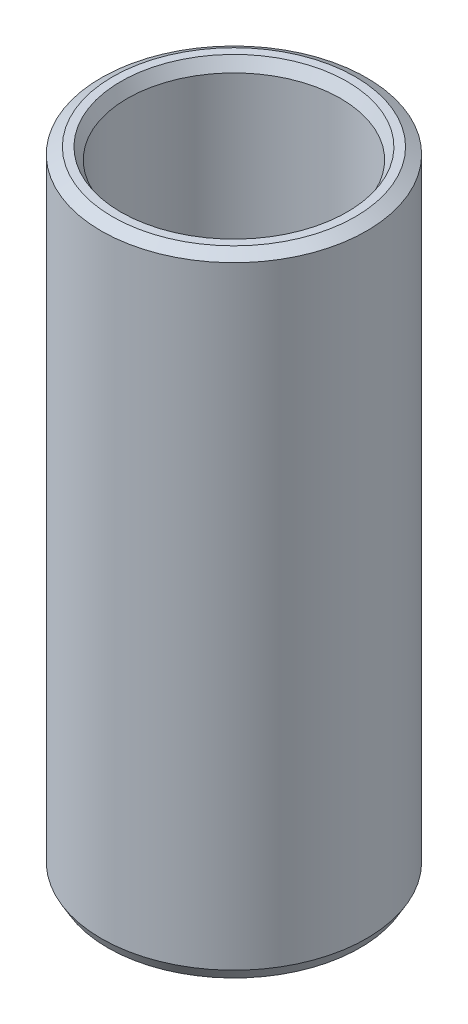
ISO-10303-21;
HEADER;
FILE_DESCRIPTION(('STEP AP214'),'2;1');
FILE_NAME('part.step','',(''),(''),'','','');
FILE_SCHEMA(('AUTOMOTIVE_DESIGN { 1 0 10303 214 1 1 1 1 }'));
ENDSEC;
DATA;
#1=APPLICATION_CONTEXT('core data for automotive mechanical design processes');
#2=APPLICATION_PROTOCOL_DEFINITION('international standard','automotive_design',2000,#1);
#3=PRODUCT_CONTEXT('',#1,'mechanical');
#4=PRODUCT('Part','Part','',(#3));
#5=PRODUCT_RELATED_PRODUCT_CATEGORY('part','',(#4));
#6=PRODUCT_DEFINITION_FORMATION('','',#4);
#7=PRODUCT_DEFINITION_CONTEXT('part definition',#1,'design');
#8=PRODUCT_DEFINITION('design','',#6,#7);
#9=PRODUCT_DEFINITION_SHAPE('','',#8);
#10=(LENGTH_UNIT() NAMED_UNIT(*) SI_UNIT(.MILLI.,.METRE.));
#11=(NAMED_UNIT(*) PLANE_ANGLE_UNIT() SI_UNIT($,.RADIAN.));
#12=(NAMED_UNIT(*) SI_UNIT($,.STERADIAN.) SOLID_ANGLE_UNIT());
#13=UNCERTAINTY_MEASURE_WITH_UNIT(LENGTH_MEASURE(1.E-05),#10,'distance_accuracy_value','');
#14=(GEOMETRIC_REPRESENTATION_CONTEXT(3) GLOBAL_UNCERTAINTY_ASSIGNED_CONTEXT((#13)) GLOBAL_UNIT_ASSIGNED_CONTEXT((#10,
#11,#12)) REPRESENTATION_CONTEXT('',''));
#15=CARTESIAN_POINT('',(0.,0.,0.));
#16=DIRECTION('',(0.,0.,1.));
#17=DIRECTION('',(1.,0.,0.));
#18=AXIS2_PLACEMENT_3D('',#15,#16,#17);
#19=CARTESIAN_POINT('',(0.,261.363555671817,0.));
#20=DIRECTION('',(0.,-1.,0.));
#21=DIRECTION('',(0.,0.,-1.));
#22=AXIS2_PLACEMENT_3D('',#19,#20,#21);
#23=CYLINDRICAL_SURFACE('',#22,55.);
#24=CARTESIAN_POINT('',(0.,4.71220692512941,0.));
#25=DIRECTION('',(0.,1.,0.));
#26=DIRECTION('',(0.,0.,1.));
#27=AXIS2_PLACEMENT_3D('',#24,#25,#26);
#28=CIRCLE('',#27,55.);
#29=CARTESIAN_POINT('',(0.,4.71220692512941,55.));
#30=VERTEX_POINT('',#29);
#31=EDGE_CURVE('E10',#30,#30,#28,.T.);
#32=ORIENTED_EDGE('',*,*,#31,.T.);
#33=EDGE_LOOP('',(#32));
#34=FACE_BOUND('',#33,.T.);
#35=CARTESIAN_POINT('',(0.,258.642961735116,0.));
#36=DIRECTION('',(0.,1.,0.));
#37=DIRECTION('',(0.,0.,1.));
#38=AXIS2_PLACEMENT_3D('',#35,#36,#37);
#39=CIRCLE('',#38,55.);
#40=CARTESIAN_POINT('',(0.,258.642961735116,55.));
#41=VERTEX_POINT('',#40);
#42=EDGE_CURVE('E50',#41,#41,#39,.F.);
#43=ORIENTED_EDGE('',*,*,#42,.T.);
#44=EDGE_LOOP('',(#43));
#45=FACE_BOUND('',#44,.T.);
#46=ADVANCED_FACE('F39',(#34,#45),#23,.T.);
#47=CARTESIAN_POINT('',(0.,261.363555671817,0.));
#48=DIRECTION('',(0.,1.,0.));
#49=DIRECTION('',(0.,0.,1.));
#50=AXIS2_PLACEMENT_3D('',#47,#48,#49);
#51=PLANE('',#50);
#52=CARTESIAN_POINT('',(0.,261.363555671817,0.));
#53=DIRECTION('',(0.,1.,0.));
#54=DIRECTION('',(0.,0.,1.));
#55=AXIS2_PLACEMENT_3D('',#52,#53,#54);
#56=CIRCLE('',#55,46.890614247474);
#57=CARTESIAN_POINT('',(0.,261.363555671817,46.890614247474));
#58=VERTEX_POINT('',#57);
#59=EDGE_CURVE('E58',#58,#58,#56,.F.);
#60=ORIENTED_EDGE('',*,*,#59,.T.);
#61=EDGE_LOOP('',(#60));
#62=FACE_BOUND('',#61,.T.);
#63=CARTESIAN_POINT('',(0.,261.363555671817,0.));
#64=DIRECTION('',(0.,1.,0.));
#65=DIRECTION('',(0.,0.,1.));
#66=AXIS2_PLACEMENT_3D('',#63,#64,#65);
#67=CIRCLE('',#66,50.2877930748705);
#68=CARTESIAN_POINT('',(0.,261.363555671817,50.2877930748705));
#69=VERTEX_POINT('',#68);
#70=EDGE_CURVE('E61',#69,#69,#67,.T.);
#71=ORIENTED_EDGE('',*,*,#70,.T.);
#72=EDGE_LOOP('',(#71));
#73=FACE_BOUND('',#72,.T.);
#74=ADVANCED_FACE('F88',(#62,#73),#51,.T.);
#75=CARTESIAN_POINT('',(0.,0.,0.));
#76=DIRECTION('',(0.,1.,0.));
#77=DIRECTION('',(0.,0.,1.));
#78=AXIS2_PLACEMENT_3D('',#75,#76,#77);
#79=PLANE('',#78);
#80=CARTESIAN_POINT('',(0.,0.,0.));
#81=DIRECTION('',(0.,1.,0.));
#82=DIRECTION('',(0.,0.,1.));
#83=AXIS2_PLACEMENT_3D('',#80,#81,#82);
#84=CIRCLE('',#83,48.8822272359028);
#85=CARTESIAN_POINT('',(0.,0.,48.8822272359028));
#86=VERTEX_POINT('',#85);
#87=EDGE_CURVE('E51',#86,#86,#84,.T.);
#88=ORIENTED_EDGE('',*,*,#87,.T.);
#89=EDGE_LOOP('',(#88));
#90=FACE_BOUND('',#89,.T.);
#91=CARTESIAN_POINT('',(0.,0.,0.));
#92=DIRECTION('',(0.,1.,0.));
#93=DIRECTION('',(0.,0.,1.));
#94=AXIS2_PLACEMENT_3D('',#91,#92,#93);
#95=CIRCLE('',#94,52.2794060632993);
#96=CARTESIAN_POINT('',(0.,0.,52.2794060632993));
#97=VERTEX_POINT('',#96);
#98=EDGE_CURVE('E54',#97,#97,#95,.F.);
#99=ORIENTED_EDGE('',*,*,#98,.T.);
#100=EDGE_LOOP('',(#99));
#101=FACE_BOUND('',#100,.T.);
#102=ADVANCED_FACE('F83',(#90,#101),#79,.F.);
#103=CARTESIAN_POINT('',(0.,261.363555671817,0.));
#104=DIRECTION('',(0.,-1.,0.));
#105=DIRECTION('',(0.,0.,-1.));
#106=AXIS2_PLACEMENT_3D('',#103,#104,#105);
#107=CYLINDRICAL_SURFACE('',#106,44.1700203107733);
#108=CARTESIAN_POINT('',(0.,256.651348746687,0.));
#109=DIRECTION('',(0.,1.,0.));
#110=DIRECTION('',(0.,0.,1.));
#111=AXIS2_PLACEMENT_3D('',#108,#109,#110);
#112=CIRCLE('',#111,44.1700203107733);
#113=CARTESIAN_POINT('',(0.,256.651348746687,44.1700203107733));
#114=VERTEX_POINT('',#113);
#115=EDGE_CURVE('E67',#114,#114,#112,.T.);
#116=ORIENTED_EDGE('',*,*,#115,.T.);
#117=EDGE_LOOP('',(#116));
#118=FACE_BOUND('',#117,.T.);
#119=CARTESIAN_POINT('',(0.,2.72059393670071,0.));
#120=DIRECTION('',(0.,1.,0.));
#121=DIRECTION('',(0.,0.,1.));
#122=AXIS2_PLACEMENT_3D('',#119,#120,#121);
#123=CIRCLE('',#122,44.1700203107733);
#124=CARTESIAN_POINT('',(0.,2.72059393670071,44.1700203107733));
#125=VERTEX_POINT('',#124);
#126=EDGE_CURVE('E69',#125,#125,#123,.F.);
#127=ORIENTED_EDGE('',*,*,#126,.T.);
#128=EDGE_LOOP('',(#127));
#129=FACE_BOUND('',#128,.T.);
#130=ADVANCED_FACE('F71',(#118,#129),#107,.F.);
#131=CARTESIAN_POINT('',(0.,256.651348746687,0.));
#132=DIRECTION('',(0.,1.,0.));
#133=DIRECTION('',(0.,0.,1.));
#134=AXIS2_PLACEMENT_3D('',#131,#132,#133);
#135=CONICAL_SURFACE('',#134,44.1700203107733,0.5235987755983);
#136=ORIENTED_EDGE('',*,*,#59,.F.);
#137=EDGE_LOOP('',(#136));
#138=FACE_BOUND('',#137,.T.);
#139=ORIENTED_EDGE('',*,*,#115,.F.);
#140=EDGE_LOOP('',(#139));
#141=FACE_BOUND('',#140,.T.);
#142=ADVANCED_FACE('F77',(#138,#141),#135,.F.);
#143=CARTESIAN_POINT('',(0.,0.,0.));
#144=DIRECTION('',(0.,-1.,0.));
#145=DIRECTION('',(0.,0.,-1.));
#146=AXIS2_PLACEMENT_3D('',#143,#144,#145);
#147=CONICAL_SURFACE('',#146,48.8822272359028,1.0471975511966);
#148=ORIENTED_EDGE('',*,*,#126,.F.);
#149=EDGE_LOOP('',(#148));
#150=FACE_BOUND('',#149,.T.);
#151=ORIENTED_EDGE('',*,*,#87,.F.);
#152=EDGE_LOOP('',(#151));
#153=FACE_BOUND('',#152,.T.);
#154=ADVANCED_FACE('F73',(#150,#153),#147,.F.);
#155=CARTESIAN_POINT('',(0.,4.71220692512941,0.));
#156=DIRECTION('',(0.,1.,0.));
#157=DIRECTION('',(0.,0.,1.));
#158=AXIS2_PLACEMENT_3D('',#155,#156,#157);
#159=CONICAL_SURFACE('',#158,55.,0.523598775598304);
#160=ORIENTED_EDGE('',*,*,#98,.F.);
#161=EDGE_LOOP('',(#160));
#162=FACE_BOUND('',#161,.T.);
#163=ORIENTED_EDGE('',*,*,#31,.F.);
#164=EDGE_LOOP('',(#163));
#165=FACE_BOUND('',#164,.T.);
#166=ADVANCED_FACE('F76',(#162,#165),#159,.T.);
#167=CARTESIAN_POINT('',(0.,261.363555671817,0.));
#168=DIRECTION('',(0.,-1.,0.));
#169=DIRECTION('',(0.,0.,-1.));
#170=AXIS2_PLACEMENT_3D('',#167,#168,#169);
#171=CONICAL_SURFACE('',#170,50.2877930748705,1.0471975511966);
#172=ORIENTED_EDGE('',*,*,#42,.F.);
#173=EDGE_LOOP('',(#172));
#174=FACE_BOUND('',#173,.T.);
#175=ORIENTED_EDGE('',*,*,#70,.F.);
#176=EDGE_LOOP('',(#175));
#177=FACE_BOUND('',#176,.T.);
#178=ADVANCED_FACE('F45',(#174,#177),#171,.T.);
#179=CLOSED_SHELL('',(#46,#74,#102,#130,#142,#154,#166,#178));
#180=MANIFOLD_SOLID_BREP('B2',#179);
#181=ADVANCED_BREP_SHAPE_REPRESENTATION('',(#18,#180),#14);
#182=SHAPE_DEFINITION_REPRESENTATION(#9,#181);
ENDSEC;
END-ISO-10303-21;
